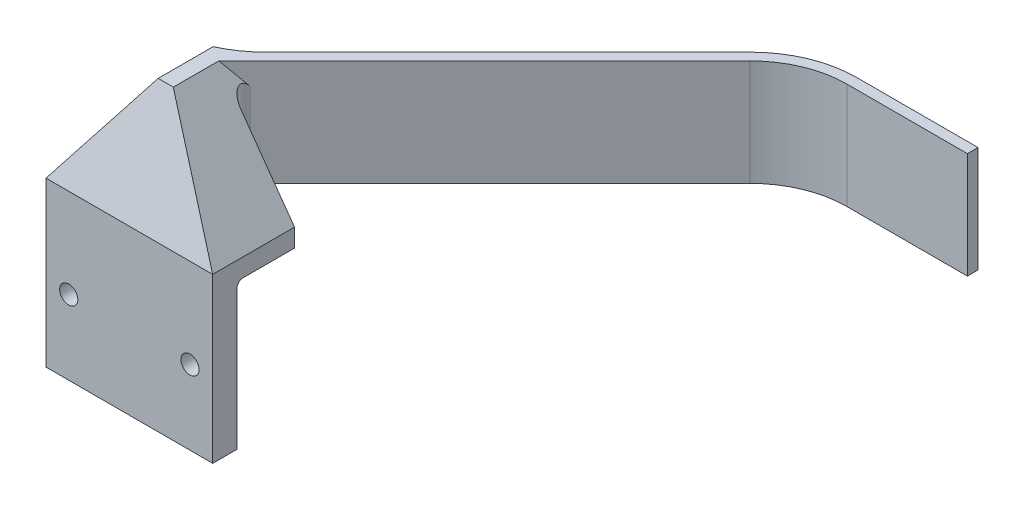
ISO-10303-21;
HEADER;
FILE_DESCRIPTION(('STEP AP214'),'2;1');
FILE_NAME('part.step','',(''),(''),'','','');
FILE_SCHEMA(('AUTOMOTIVE_DESIGN { 1 0 10303 214 1 1 1 1 }'));
ENDSEC;
DATA;
#1=APPLICATION_CONTEXT('core data for automotive mechanical design processes');
#2=APPLICATION_PROTOCOL_DEFINITION('international standard','automotive_design',2000,#1);
#3=PRODUCT_CONTEXT('',#1,'mechanical');
#4=PRODUCT('Part','Part','',(#3));
#5=PRODUCT_RELATED_PRODUCT_CATEGORY('part','',(#4));
#6=PRODUCT_DEFINITION_FORMATION('','',#4);
#7=PRODUCT_DEFINITION_CONTEXT('part definition',#1,'design');
#8=PRODUCT_DEFINITION('design','',#6,#7);
#9=PRODUCT_DEFINITION_SHAPE('','',#8);
#10=(LENGTH_UNIT() NAMED_UNIT(*) SI_UNIT(.MILLI.,.METRE.));
#11=(NAMED_UNIT(*) PLANE_ANGLE_UNIT() SI_UNIT($,.RADIAN.));
#12=(NAMED_UNIT(*) SI_UNIT($,.STERADIAN.) SOLID_ANGLE_UNIT());
#13=UNCERTAINTY_MEASURE_WITH_UNIT(LENGTH_MEASURE(1.E-05),#10,'distance_accuracy_value','');
#14=(GEOMETRIC_REPRESENTATION_CONTEXT(3) GLOBAL_UNCERTAINTY_ASSIGNED_CONTEXT((#13)) GLOBAL_UNIT_ASSIGNED_CONTEXT((#10,
#11,#12)) REPRESENTATION_CONTEXT('',''));
#15=CARTESIAN_POINT('',(0.,0.,0.));
#16=DIRECTION('',(0.,0.,1.));
#17=DIRECTION('',(1.,0.,0.));
#18=AXIS2_PLACEMENT_3D('',#15,#16,#17);
#19=CARTESIAN_POINT('',(-27.5,30.,-19.));
#20=DIRECTION('',(0.,0.,1.));
#21=DIRECTION('',(1.,0.,0.));
#22=AXIS2_PLACEMENT_3D('',#19,#20,#21);
#23=PLANE('',#22);
#24=DIRECTION('',(1.,0.,0.));
#25=VECTOR('',#24,1.);
#26=CARTESIAN_POINT('',(2.5,30.,-19.));
#27=LINE('',#26,#25);
#28=CARTESIAN_POINT('',(-16.9974746830584,30.,-19.));
#29=VERTEX_POINT('',#28);
#30=CARTESIAN_POINT('',(9.74264068711933,30.,-19.));
#31=VERTEX_POINT('',#30);
#32=EDGE_CURVE('E336',#29,#31,#27,.T.);
#33=ORIENTED_EDGE('',*,*,#32,.T.);
#34=DIRECTION('',(0.,1.,0.));
#35=VECTOR('',#34,1.);
#36=CARTESIAN_POINT('',(9.74264068711933,30.,-19.));
#37=LINE('',#36,#35);
#38=CARTESIAN_POINT('',(9.74264068711933,54.8603030380329,-19.));
#39=VERTEX_POINT('',#38);
#40=EDGE_CURVE('E323',#31,#39,#37,.T.);
#41=ORIENTED_EDGE('',*,*,#40,.T.);
#42=DIRECTION('',(0.581238193719096,-0.813733471206735,0.));
#43=VECTOR('',#42,1.);
#44=CARTESIAN_POINT('',(27.5,30.,-19.));
#45=LINE('',#44,#43);
#46=CARTESIAN_POINT('',(27.5,30.,-19.));
#47=VERTEX_POINT('',#46);
#48=EDGE_CURVE('E220',#39,#47,#45,.T.);
#49=ORIENTED_EDGE('',*,*,#48,.T.);
#50=DIRECTION('',(0.,-1.,0.));
#51=VECTOR('',#50,1.);
#52=CARTESIAN_POINT('',(27.5,30.,-19.));
#53=LINE('',#52,#51);
#54=CARTESIAN_POINT('',(27.5,24.,-19.));
#55=VERTEX_POINT('',#54);
#56=EDGE_CURVE('E250',#47,#55,#53,.T.);
#57=ORIENTED_EDGE('',*,*,#56,.T.);
#58=DIRECTION('',(-1.,0.,0.));
#59=VECTOR('',#58,1.);
#60=CARTESIAN_POINT('',(-27.5,24.,-19.));
#61=LINE('',#60,#59);
#62=CARTESIAN_POINT('',(-27.5,24.,-19.));
#63=VERTEX_POINT('',#62);
#64=EDGE_CURVE('E237',#55,#63,#61,.T.);
#65=ORIENTED_EDGE('',*,*,#64,.T.);
#66=DIRECTION('',(0.,-1.,0.));
#67=VECTOR('',#66,1.);
#68=CARTESIAN_POINT('',(-27.5,30.,-19.));
#69=LINE('',#68,#67);
#70=CARTESIAN_POINT('',(-27.5,30.,-19.));
#71=VERTEX_POINT('',#70);
#72=EDGE_CURVE('E242',#71,#63,#69,.T.);
#73=ORIENTED_EDGE('',*,*,#72,.F.);
#74=DIRECTION('',(-0.581238193719096,-0.813733471206735,0.));
#75=VECTOR('',#74,1.);
#76=CARTESIAN_POINT('',(-27.5,30.,-19.));
#77=LINE('',#76,#75);
#78=CARTESIAN_POINT('',(-16.9974746830584,44.7035354437182,-19.));
#79=VERTEX_POINT('',#78);
#80=EDGE_CURVE('E214',#79,#71,#77,.T.);
#81=ORIENTED_EDGE('',*,*,#80,.F.);
#82=DIRECTION('',(0.,1.,0.));
#83=VECTOR('',#82,1.);
#84=CARTESIAN_POINT('',(-16.9974746830584,30.,-19.));
#85=LINE('',#84,#83);
#86=EDGE_CURVE('E313',#79,#29,#85,.F.);
#87=ORIENTED_EDGE('',*,*,#86,.T.);
#88=EDGE_LOOP('',(#33,#41,#49,#57,#65,#73,#81,#87));
#89=FACE_BOUND('',#88,.T.);
#90=ADVANCED_FACE('F41',(#89),#23,.F.);
#91=CARTESIAN_POINT('',(0.,0.,8.));
#92=DIRECTION('',(0.,0.,-1.));
#93=DIRECTION('',(-1.,0.,0.));
#94=AXIS2_PLACEMENT_3D('',#91,#92,#93);
#95=PLANE('',#94);
#96=DIRECTION('',(0.,1.,0.));
#97=VECTOR('',#96,1.);
#98=CARTESIAN_POINT('',(27.5,-24.,8.));
#99=LINE('',#98,#97);
#100=CARTESIAN_POINT('',(27.5,-24.,8.));
#101=VERTEX_POINT('',#100);
#102=CARTESIAN_POINT('',(27.5,30.,8.));
#103=VERTEX_POINT('',#102);
#104=EDGE_CURVE('E266',#101,#103,#99,.T.);
#105=ORIENTED_EDGE('',*,*,#104,.T.);
#106=DIRECTION('',(1.,0.,0.));
#107=VECTOR('',#106,1.);
#108=CARTESIAN_POINT('',(-27.5,30.,8.));
#109=LINE('',#108,#107);
#110=CARTESIAN_POINT('',(-27.5,30.,8.));
#111=VERTEX_POINT('',#110);
#112=EDGE_CURVE('E236',#111,#103,#109,.T.);
#113=ORIENTED_EDGE('',*,*,#112,.F.);
#114=DIRECTION('',(0.,-1.,0.));
#115=VECTOR('',#114,1.);
#116=CARTESIAN_POINT('',(-27.5,-24.,8.));
#117=LINE('',#116,#115);
#118=CARTESIAN_POINT('',(-27.5,-24.,8.));
#119=VERTEX_POINT('',#118);
#120=EDGE_CURVE('E269',#111,#119,#117,.T.);
#121=ORIENTED_EDGE('',*,*,#120,.T.);
#122=DIRECTION('',(1.,0.,0.));
#123=VECTOR('',#122,1.);
#124=CARTESIAN_POINT('',(-27.5,-24.,8.));
#125=LINE('',#124,#123);
#126=EDGE_CURVE('E272',#119,#101,#125,.T.);
#127=ORIENTED_EDGE('',*,*,#126,.T.);
#128=EDGE_LOOP('',(#105,#113,#121,#127));
#129=FACE_BOUND('',#128,.T.);
#130=CARTESIAN_POINT('',(20.,0.5,8.));
#131=DIRECTION('',(0.,0.,1.));
#132=DIRECTION('',(1.,0.,0.));
#133=AXIS2_PLACEMENT_3D('',#130,#131,#132);
#134=CIRCLE('',#133,3.);
#135=CARTESIAN_POINT('',(23.,0.5,8.));
#136=VERTEX_POINT('',#135);
#137=EDGE_CURVE('E260',#136,#136,#134,.T.);
#138=ORIENTED_EDGE('',*,*,#137,.F.);
#139=EDGE_LOOP('',(#138));
#140=FACE_BOUND('',#139,.T.);
#141=CARTESIAN_POINT('',(-20.,0.5,8.));
#142=DIRECTION('',(0.,0.,1.));
#143=DIRECTION('',(1.,0.,0.));
#144=AXIS2_PLACEMENT_3D('',#141,#142,#143);
#145=CIRCLE('',#144,3.);
#146=CARTESIAN_POINT('',(-17.,0.5,8.));
#147=VERTEX_POINT('',#146);
#148=EDGE_CURVE('E254',#147,#147,#145,.T.);
#149=ORIENTED_EDGE('',*,*,#148,.F.);
#150=EDGE_LOOP('',(#149));
#151=FACE_BOUND('',#150,.T.);
#152=ADVANCED_FACE('F371',(#129,#140,#151),#95,.F.);
#153=CARTESIAN_POINT('',(0.,0.,0.));
#154=DIRECTION('',(0.,0.,-1.));
#155=DIRECTION('',(-1.,0.,0.));
#156=AXIS2_PLACEMENT_3D('',#153,#154,#155);
#157=PLANE('',#156);
#158=DIRECTION('',(0.,1.,0.));
#159=VECTOR('',#158,1.);
#160=CARTESIAN_POINT('',(27.5,-24.,0.));
#161=LINE('',#160,#159);
#162=CARTESIAN_POINT('',(27.5,-24.,0.));
#163=VERTEX_POINT('',#162);
#164=CARTESIAN_POINT('',(27.5,22.,0.));
#165=VERTEX_POINT('',#164);
#166=EDGE_CURVE('E263',#163,#165,#161,.T.);
#167=ORIENTED_EDGE('',*,*,#166,.F.);
#168=DIRECTION('',(1.,0.,0.));
#169=VECTOR('',#168,1.);
#170=CARTESIAN_POINT('',(-27.5,-24.,0.));
#171=LINE('',#170,#169);
#172=CARTESIAN_POINT('',(-27.5,-24.,0.));
#173=VERTEX_POINT('',#172);
#174=EDGE_CURVE('E270',#173,#163,#171,.T.);
#175=ORIENTED_EDGE('',*,*,#174,.F.);
#176=DIRECTION('',(0.,-1.,0.));
#177=VECTOR('',#176,1.);
#178=CARTESIAN_POINT('',(-27.5,-24.,0.));
#179=LINE('',#178,#177);
#180=CARTESIAN_POINT('',(-27.5,22.,0.));
#181=VERTEX_POINT('',#180);
#182=EDGE_CURVE('E277',#181,#173,#179,.T.);
#183=ORIENTED_EDGE('',*,*,#182,.F.);
#184=DIRECTION('',(-1.,0.,0.));
#185=VECTOR('',#184,1.);
#186=CARTESIAN_POINT('',(27.5,22.,0.));
#187=LINE('',#186,#185);
#188=EDGE_CURVE('E287',#181,#165,#187,.F.);
#189=ORIENTED_EDGE('',*,*,#188,.T.);
#190=EDGE_LOOP('',(#167,#175,#183,#189));
#191=FACE_BOUND('',#190,.T.);
#192=CARTESIAN_POINT('',(20.,0.5,0.));
#193=DIRECTION('',(0.,0.,1.));
#194=DIRECTION('',(1.,0.,0.));
#195=AXIS2_PLACEMENT_3D('',#192,#193,#194);
#196=CIRCLE('',#195,3.);
#197=CARTESIAN_POINT('',(23.,0.5,0.));
#198=VERTEX_POINT('',#197);
#199=EDGE_CURVE('E257',#198,#198,#196,.T.);
#200=ORIENTED_EDGE('',*,*,#199,.T.);
#201=EDGE_LOOP('',(#200));
#202=FACE_BOUND('',#201,.T.);
#203=CARTESIAN_POINT('',(-20.,0.5,0.));
#204=DIRECTION('',(0.,0.,1.));
#205=DIRECTION('',(1.,0.,0.));
#206=AXIS2_PLACEMENT_3D('',#203,#204,#205);
#207=CIRCLE('',#206,3.);
#208=CARTESIAN_POINT('',(-17.,0.5,0.));
#209=VERTEX_POINT('',#208);
#210=EDGE_CURVE('E253',#209,#209,#207,.T.);
#211=ORIENTED_EDGE('',*,*,#210,.T.);
#212=EDGE_LOOP('',(#211));
#213=FACE_BOUND('',#212,.T.);
#214=ADVANCED_FACE('F407',(#191,#202,#213),#157,.T.);
#215=CARTESIAN_POINT('',(27.5,-24.,8.));
#216=DIRECTION('',(-1.,0.,0.));
#217=DIRECTION('',(0.,0.,1.));
#218=AXIS2_PLACEMENT_3D('',#215,#216,#217);
#219=PLANE('',#218);
#220=ORIENTED_EDGE('',*,*,#166,.T.);
#221=CARTESIAN_POINT('',(27.5,22.,-2.));
#222=DIRECTION('',(-1.,0.,0.));
#223=DIRECTION('',(0.,0.,1.));
#224=AXIS2_PLACEMENT_3D('',#221,#222,#223);
#225=CIRCLE('',#224,2.);
#226=CARTESIAN_POINT('',(27.5,24.,-2.));
#227=VERTEX_POINT('',#226);
#228=EDGE_CURVE('E291',#165,#227,#225,.T.);
#229=ORIENTED_EDGE('',*,*,#228,.T.);
#230=DIRECTION('',(0.,0.,-1.));
#231=VECTOR('',#230,1.);
#232=CARTESIAN_POINT('',(27.5,24.,8.));
#233=LINE('',#232,#231);
#234=EDGE_CURVE('E245',#227,#55,#233,.T.);
#235=ORIENTED_EDGE('',*,*,#234,.T.);
#236=ORIENTED_EDGE('',*,*,#56,.F.);
#237=DIRECTION('',(0.,0.,-1.));
#238=VECTOR('',#237,1.);
#239=CARTESIAN_POINT('',(27.5,30.,8.));
#240=LINE('',#239,#238);
#241=EDGE_CURVE('E239',#103,#47,#240,.T.);
#242=ORIENTED_EDGE('',*,*,#241,.F.);
#243=ORIENTED_EDGE('',*,*,#104,.F.);
#244=DIRECTION('',(0.,0.,-1.));
#245=VECTOR('',#244,1.);
#246=CARTESIAN_POINT('',(27.5,-24.,8.));
#247=LINE('',#246,#245);
#248=EDGE_CURVE('E274',#101,#163,#247,.T.);
#249=ORIENTED_EDGE('',*,*,#248,.T.);
#250=EDGE_LOOP('',(#220,#229,#235,#236,#242,#243,#249));
#251=FACE_BOUND('',#250,.T.);
#252=ADVANCED_FACE('F377',(#251),#219,.F.);
#253=CARTESIAN_POINT('',(-27.5,-24.,8.));
#254=DIRECTION('',(1.,0.,0.));
#255=DIRECTION('',(0.,0.,-1.));
#256=AXIS2_PLACEMENT_3D('',#253,#254,#255);
#257=PLANE('',#256);
#258=DIRECTION('',(0.,0.,1.));
#259=VECTOR('',#258,1.);
#260=CARTESIAN_POINT('',(-27.5,24.,8.));
#261=LINE('',#260,#259);
#262=CARTESIAN_POINT('',(-27.5,24.,-2.));
#263=VERTEX_POINT('',#262);
#264=EDGE_CURVE('E233',#63,#263,#261,.T.);
#265=ORIENTED_EDGE('',*,*,#264,.T.);
#266=CARTESIAN_POINT('',(-27.5,22.,-2.));
#267=DIRECTION('',(1.,0.,0.));
#268=DIRECTION('',(0.,0.,-1.));
#269=AXIS2_PLACEMENT_3D('',#266,#267,#268);
#270=CIRCLE('',#269,2.);
#271=EDGE_CURVE('E289',#263,#181,#270,.T.);
#272=ORIENTED_EDGE('',*,*,#271,.T.);
#273=ORIENTED_EDGE('',*,*,#182,.T.);
#274=DIRECTION('',(0.,0.,-1.));
#275=VECTOR('',#274,1.);
#276=CARTESIAN_POINT('',(-27.5,-24.,8.));
#277=LINE('',#276,#275);
#278=EDGE_CURVE('E282',#119,#173,#277,.T.);
#279=ORIENTED_EDGE('',*,*,#278,.F.);
#280=ORIENTED_EDGE('',*,*,#120,.F.);
#281=DIRECTION('',(0.,0.,1.));
#282=VECTOR('',#281,1.);
#283=CARTESIAN_POINT('',(-27.5,30.,8.));
#284=LINE('',#283,#282);
#285=EDGE_CURVE('E234',#71,#111,#284,.T.);
#286=ORIENTED_EDGE('',*,*,#285,.F.);
#287=ORIENTED_EDGE('',*,*,#72,.T.);
#288=EDGE_LOOP('',(#265,#272,#273,#279,#280,#286,#287));
#289=FACE_BOUND('',#288,.T.);
#290=ADVANCED_FACE('F388',(#289),#257,.F.);
#291=CARTESIAN_POINT('',(-27.5,-24.,8.));
#292=DIRECTION('',(0.,1.,0.));
#293=DIRECTION('',(0.,0.,1.));
#294=AXIS2_PLACEMENT_3D('',#291,#292,#293);
#295=PLANE('',#294);
#296=ORIENTED_EDGE('',*,*,#248,.F.);
#297=ORIENTED_EDGE('',*,*,#126,.F.);
#298=ORIENTED_EDGE('',*,*,#278,.T.);
#299=ORIENTED_EDGE('',*,*,#174,.T.);
#300=EDGE_LOOP('',(#296,#297,#298,#299));
#301=FACE_BOUND('',#300,.T.);
#302=ADVANCED_FACE('F418',(#301),#295,.F.);
#303=CARTESIAN_POINT('',(20.,0.5,8.));
#304=DIRECTION('',(0.,0.,-1.));
#305=DIRECTION('',(-1.,0.,0.));
#306=AXIS2_PLACEMENT_3D('',#303,#304,#305);
#307=CYLINDRICAL_SURFACE('',#306,3.);
#308=ORIENTED_EDGE('',*,*,#137,.T.);
#309=EDGE_LOOP('',(#308));
#310=FACE_BOUND('',#309,.T.);
#311=ORIENTED_EDGE('',*,*,#199,.F.);
#312=EDGE_LOOP('',(#311));
#313=FACE_BOUND('',#312,.T.);
#314=ADVANCED_FACE('F415',(#310,#313),#307,.F.);
#315=CARTESIAN_POINT('',(-20.,0.5,8.));
#316=DIRECTION('',(0.,0.,-1.));
#317=DIRECTION('',(-1.,0.,0.));
#318=AXIS2_PLACEMENT_3D('',#315,#316,#317);
#319=CYLINDRICAL_SURFACE('',#318,3.);
#320=ORIENTED_EDGE('',*,*,#148,.T.);
#321=EDGE_LOOP('',(#320));
#322=FACE_BOUND('',#321,.T.);
#323=ORIENTED_EDGE('',*,*,#210,.F.);
#324=EDGE_LOOP('',(#323));
#325=FACE_BOUND('',#324,.T.);
#326=ADVANCED_FACE('F412',(#322,#325),#319,.F.);
#327=CARTESIAN_POINT('',(0.,24.,0.));
#328=DIRECTION('',(0.,-1.,0.));
#329=DIRECTION('',(0.,0.,-1.));
#330=AXIS2_PLACEMENT_3D('',#327,#328,#329);
#331=PLANE('',#330);
#332=DIRECTION('',(-1.,0.,0.));
#333=VECTOR('',#332,1.);
#334=CARTESIAN_POINT('',(-27.5,24.,-2.));
#335=LINE('',#334,#333);
#336=EDGE_CURVE('E285',#227,#263,#335,.T.);
#337=ORIENTED_EDGE('',*,*,#336,.T.);
#338=ORIENTED_EDGE('',*,*,#264,.F.);
#339=ORIENTED_EDGE('',*,*,#64,.F.);
#340=ORIENTED_EDGE('',*,*,#234,.F.);
#341=EDGE_LOOP('',(#337,#338,#339,#340));
#342=FACE_BOUND('',#341,.T.);
#343=ADVANCED_FACE('F384',(#342),#331,.T.);
#344=CARTESIAN_POINT('',(2.5,65.,-4.));
#345=DIRECTION('',(0.,-1.,0.));
#346=DIRECTION('',(0.,0.,-1.));
#347=AXIS2_PLACEMENT_3D('',#344,#345,#346);
#348=PLANE('',#347);
#349=DIRECTION('',(-1.,0.,0.));
#350=VECTOR('',#349,1.);
#351=CARTESIAN_POINT('',(97.9999999999993,65.,-119.5));
#352=LINE('',#351,#350);
#353=CARTESIAN_POINT('',(152.5,65.,-119.5));
#354=VERTEX_POINT('',#353);
#355=CARTESIAN_POINT('',(112.497474683058,65.,-119.5));
#356=VERTEX_POINT('',#355);
#357=EDGE_CURVE('E210',#354,#356,#352,.T.);
#358=ORIENTED_EDGE('',*,*,#357,.T.);
#359=CARTESIAN_POINT('',(112.497474683058,65.,-84.5));
#360=DIRECTION('',(0.,-1.,0.));
#361=DIRECTION('',(0.,0.,-1.));
#362=AXIS2_PLACEMENT_3D('',#359,#360,#361);
#363=CIRCLE('',#362,35.);
#364=CARTESIAN_POINT('',(87.7487373415285,65.,-109.248737341529));
#365=VERTEX_POINT('',#364);
#366=EDGE_CURVE('E296',#356,#365,#363,.F.);
#367=ORIENTED_EDGE('',*,*,#366,.T.);
#368=DIRECTION('',(-0.707106781186545,0.,0.70710678118655));
#369=VECTOR('',#368,1.);
#370=CARTESIAN_POINT('',(-2.5,65.,-19.));
#371=LINE('',#370,#369);
#372=CARTESIAN_POINT('',(7.75126265847086,65.,-29.2512626584709));
#373=VERTEX_POINT('',#372);
#374=EDGE_CURVE('E201',#365,#373,#371,.T.);
#375=ORIENTED_EDGE('',*,*,#374,.T.);
#376=CARTESIAN_POINT('',(-16.9974746830584,65.,-54.));
#377=DIRECTION('',(0.,-1.,0.));
#378=DIRECTION('',(0.,0.,-1.));
#379=AXIS2_PLACEMENT_3D('',#376,#377,#378);
#380=CIRCLE('',#379,35.);
#381=CARTESIAN_POINT('',(-2.5,65.,-22.1437097606441));
#382=VERTEX_POINT('',#381);
#383=EDGE_CURVE('E316',#373,#382,#380,.T.);
#384=ORIENTED_EDGE('',*,*,#383,.T.);
#385=DIRECTION('',(0.,0.,1.));
#386=VECTOR('',#385,1.);
#387=CARTESIAN_POINT('',(-2.5,65.,-4.));
#388=LINE('',#387,#386);
#389=CARTESIAN_POINT('',(-2.5,65.,-4.));
#390=VERTEX_POINT('',#389);
#391=EDGE_CURVE('E225',#382,#390,#388,.T.);
#392=ORIENTED_EDGE('',*,*,#391,.T.);
#393=DIRECTION('',(-1.,0.,0.));
#394=VECTOR('',#393,1.);
#395=CARTESIAN_POINT('',(2.5,65.,-4.));
#396=LINE('',#395,#394);
#397=CARTESIAN_POINT('',(2.5,65.,-4.));
#398=VERTEX_POINT('',#397);
#399=EDGE_CURVE('E228',#398,#390,#396,.T.);
#400=ORIENTED_EDGE('',*,*,#399,.F.);
#401=DIRECTION('',(0.,0.,1.));
#402=VECTOR('',#401,1.);
#403=CARTESIAN_POINT('',(2.5,65.,-4.));
#404=LINE('',#403,#402);
#405=CARTESIAN_POINT('',(2.5,65.,-19.));
#406=VERTEX_POINT('',#405);
#407=EDGE_CURVE('E226',#406,#398,#404,.T.);
#408=ORIENTED_EDGE('',*,*,#407,.F.);
#409=DIRECTION('',(0.707106781186551,0.,-0.707106781186544));
#410=VECTOR('',#409,1.);
#411=CARTESIAN_POINT('',(99.5000000000009,65.,-116.));
#412=LINE('',#411,#410);
#413=CARTESIAN_POINT('',(90.1274169979704,65.,-106.62741699797));
#414=VERTEX_POINT('',#413);
#415=EDGE_CURVE('E204',#406,#414,#412,.T.);
#416=ORIENTED_EDGE('',*,*,#415,.T.);
#417=CARTESIAN_POINT('',(112.75483399594,65.,-84.));
#418=DIRECTION('',(0.,-1.,0.));
#419=DIRECTION('',(0.,0.,-1.));
#420=AXIS2_PLACEMENT_3D('',#417,#418,#419);
#421=CIRCLE('',#420,32.);
#422=CARTESIAN_POINT('',(112.75483399594,65.,-116.));
#423=VERTEX_POINT('',#422);
#424=EDGE_CURVE('E306',#414,#423,#421,.T.);
#425=ORIENTED_EDGE('',*,*,#424,.T.);
#426=DIRECTION('',(1.,0.,0.));
#427=VECTOR('',#426,1.);
#428=CARTESIAN_POINT('',(152.5,65.,-116.));
#429=LINE('',#428,#427);
#430=CARTESIAN_POINT('',(152.5,65.,-116.));
#431=VERTEX_POINT('',#430);
#432=EDGE_CURVE('E207',#423,#431,#429,.T.);
#433=ORIENTED_EDGE('',*,*,#432,.T.);
#434=DIRECTION('',(0.,0.,-1.));
#435=VECTOR('',#434,1.);
#436=CARTESIAN_POINT('',(152.5,65.,-119.5));
#437=LINE('',#436,#435);
#438=EDGE_CURVE('E190',#431,#354,#437,.T.);
#439=ORIENTED_EDGE('',*,*,#438,.T.);
#440=EDGE_LOOP('',(#358,#367,#375,#384,#392,#400,#408,#416,#425,#433,#439));
#441=FACE_BOUND('',#440,.T.);
#442=ADVANCED_FACE('F353',(#441),#348,.F.);
#443=CARTESIAN_POINT('',(0.,22.,-2.));
#444=DIRECTION('',(1.,0.,0.));
#445=DIRECTION('',(0.,0.,-1.));
#446=AXIS2_PLACEMENT_3D('',#443,#444,#445);
#447=CYLINDRICAL_SURFACE('',#446,2.);
#448=ORIENTED_EDGE('',*,*,#228,.F.);
#449=ORIENTED_EDGE('',*,*,#188,.F.);
#450=ORIENTED_EDGE('',*,*,#271,.F.);
#451=ORIENTED_EDGE('',*,*,#336,.F.);
#452=EDGE_LOOP('',(#448,#449,#450,#451));
#453=FACE_BOUND('',#452,.T.);
#454=ADVANCED_FACE('F431',(#453),#447,.F.);
#455=CARTESIAN_POINT('',(0.,65.,-4.));
#456=DIRECTION('',(0.,0.324324324324324,0.945945945945946));
#457=DIRECTION('',(0.,-0.945945945945946,0.324324324324324));
#458=AXIS2_PLACEMENT_3D('',#455,#456,#457);
#459=PLANE('',#458);
#460=ORIENTED_EDGE('',*,*,#399,.T.);
#461=DIRECTION('',(-0.559857411277987,-0.783800375789181,0.268731557413434));
#462=VECTOR('',#461,1.);
#463=CARTESIAN_POINT('',(-33.2533395102493,21.9453246856509,10.7616029649197));
#464=LINE('',#463,#462);
#465=EDGE_CURVE('E217',#390,#111,#464,.T.);
#466=ORIENTED_EDGE('',*,*,#465,.T.);
#467=ORIENTED_EDGE('',*,*,#112,.T.);
#468=DIRECTION('',(0.559857411277987,-0.783800375789181,0.268731557413434));
#469=VECTOR('',#468,1.);
#470=CARTESIAN_POINT('',(33.2533395102493,21.9453246856509,10.7616029649197));
#471=LINE('',#470,#469);
#472=EDGE_CURVE('E222',#398,#103,#471,.T.);
#473=ORIENTED_EDGE('',*,*,#472,.F.);
#474=EDGE_LOOP('',(#460,#466,#467,#473));
#475=FACE_BOUND('',#474,.T.);
#476=ADVANCED_FACE('F366',(#475),#459,.T.);
#477=CARTESIAN_POINT('',(27.5,30.,46.2405299447906));
#478=DIRECTION('',(0.813733471206735,0.581238193719096,0.));
#479=DIRECTION('',(-0.581238193719096,0.813733471206735,0.));
#480=AXIS2_PLACEMENT_3D('',#477,#478,#479);
#481=PLANE('',#480);
#482=ORIENTED_EDGE('',*,*,#407,.T.);
#483=ORIENTED_EDGE('',*,*,#472,.T.);
#484=ORIENTED_EDGE('',*,*,#241,.T.);
#485=ORIENTED_EDGE('',*,*,#48,.F.);
#486=CARTESIAN_POINT('',(9.74264068711933,54.8603030380329,-22.));
#487=DIRECTION('',(0.813733471206735,0.581238193719096,0.));
#488=DIRECTION('',(-0.581238193719096,0.813733471206735,0.));
#489=AXIS2_PLACEMENT_3D('',#486,#487,#488);
#490=ELLIPSE('',#489,5.16139516022558,3.);
#491=CARTESIAN_POINT('',(7.62132034355972,57.8301515190164,-24.1213203435597));
#492=VERTEX_POINT('',#491);
#493=EDGE_CURVE('E49',#39,#492,#490,.F.);
#494=ORIENTED_EDGE('',*,*,#493,.T.);
#495=DIRECTION('',(0.502518907629607,-0.70352647068145,-0.502518907629603));
#496=VECTOR('',#495,1.);
#497=CARTESIAN_POINT('',(4.7119873876793,61.903217657249,-21.2119873876793));
#498=LINE('',#497,#496);
#499=EDGE_CURVE('E56',#406,#492,#498,.T.);
#500=ORIENTED_EDGE('',*,*,#499,.F.);
#501=EDGE_LOOP('',(#482,#483,#484,#485,#494,#500));
#502=FACE_BOUND('',#501,.T.);
#503=ADVANCED_FACE('F363',(#502),#481,.T.);
#504=CARTESIAN_POINT('',(-27.5,30.,46.2405299447906));
#505=DIRECTION('',(0.813733471206735,-0.581238193719096,0.));
#506=DIRECTION('',(0.581238193719096,0.813733471206735,0.));
#507=AXIS2_PLACEMENT_3D('',#504,#505,#506);
#508=PLANE('',#507);
#509=ORIENTED_EDGE('',*,*,#465,.F.);
#510=ORIENTED_EDGE('',*,*,#391,.F.);
#511=CARTESIAN_POINT('',(-16.9974746830584,44.7035354437182,-54.));
#512=DIRECTION('',(0.813733471206735,-0.581238193719096,0.));
#513=DIRECTION('',(0.581238193719096,0.813733471206735,0.));
#514=AXIS2_PLACEMENT_3D('',#511,#512,#513);
#515=ELLIPSE('',#514,60.2162768692984,35.);
#516=EDGE_CURVE('E319',#382,#79,#515,.T.);
#517=ORIENTED_EDGE('',*,*,#516,.T.);
#518=ORIENTED_EDGE('',*,*,#80,.T.);
#519=ORIENTED_EDGE('',*,*,#285,.T.);
#520=EDGE_LOOP('',(#509,#510,#517,#518,#519));
#521=FACE_BOUND('',#520,.T.);
#522=ADVANCED_FACE('F393',(#521),#508,.F.);
#523=CARTESIAN_POINT('',(-2.5,30.,-19.));
#524=DIRECTION('',(-0.70710678118655,0.,-0.707106781186545));
#525=DIRECTION('',(-0.707106781186545,0.,0.70710678118655));
#526=AXIS2_PLACEMENT_3D('',#523,#524,#525);
#527=PLANE('',#526);
#528=DIRECTION('',(-0.707106781186545,0.,0.70710678118655));
#529=VECTOR('',#528,1.);
#530=CARTESIAN_POINT('',(-2.5,30.,-19.));
#531=LINE('',#530,#529);
#532=CARTESIAN_POINT('',(87.7487373415285,30.,-109.248737341529));
#533=VERTEX_POINT('',#532);
#534=CARTESIAN_POINT('',(7.75126265847086,30.,-29.2512626584709));
#535=VERTEX_POINT('',#534);
#536=EDGE_CURVE('E213',#533,#535,#531,.T.);
#537=ORIENTED_EDGE('',*,*,#536,.T.);
#538=DIRECTION('',(0.,1.,0.));
#539=VECTOR('',#538,1.);
#540=CARTESIAN_POINT('',(7.75126265847086,30.,-29.2512626584709));
#541=LINE('',#540,#539);
#542=EDGE_CURVE('E310',#535,#373,#541,.T.);
#543=ORIENTED_EDGE('',*,*,#542,.T.);
#544=ORIENTED_EDGE('',*,*,#374,.F.);
#545=DIRECTION('',(0.,1.,0.));
#546=VECTOR('',#545,1.);
#547=CARTESIAN_POINT('',(87.7487373415284,30.,-109.248737341529));
#548=LINE('',#547,#546);
#549=EDGE_CURVE('E298',#365,#533,#548,.F.);
#550=ORIENTED_EDGE('',*,*,#549,.T.);
#551=EDGE_LOOP('',(#537,#543,#544,#550));
#552=FACE_BOUND('',#551,.T.);
#553=ADVANCED_FACE('F343',(#552),#527,.T.);
#554=CARTESIAN_POINT('',(97.9999999999993,30.,-119.5));
#555=DIRECTION('',(0.,0.,-1.));
#556=DIRECTION('',(-1.,0.,0.));
#557=AXIS2_PLACEMENT_3D('',#554,#555,#556);
#558=PLANE('',#557);
#559=DIRECTION('',(-1.,0.,0.));
#560=VECTOR('',#559,1.);
#561=CARTESIAN_POINT('',(97.9999999999993,30.,-119.5));
#562=LINE('',#561,#560);
#563=CARTESIAN_POINT('',(152.5,30.,-119.5));
#564=VERTEX_POINT('',#563);
#565=CARTESIAN_POINT('',(112.497474683058,30.,-119.5));
#566=VERTEX_POINT('',#565);
#567=EDGE_CURVE('E192',#564,#566,#562,.T.);
#568=ORIENTED_EDGE('',*,*,#567,.T.);
#569=DIRECTION('',(0.,1.,0.));
#570=VECTOR('',#569,1.);
#571=CARTESIAN_POINT('',(112.497474683058,30.,-119.5));
#572=LINE('',#571,#570);
#573=EDGE_CURVE('E293',#566,#356,#572,.T.);
#574=ORIENTED_EDGE('',*,*,#573,.T.);
#575=ORIENTED_EDGE('',*,*,#357,.F.);
#576=DIRECTION('',(0.,1.,0.));
#577=VECTOR('',#576,1.);
#578=CARTESIAN_POINT('',(152.5,30.,-119.5));
#579=LINE('',#578,#577);
#580=EDGE_CURVE('E191',#564,#354,#579,.T.);
#581=ORIENTED_EDGE('',*,*,#580,.F.);
#582=EDGE_LOOP('',(#568,#574,#575,#581));
#583=FACE_BOUND('',#582,.T.);
#584=ADVANCED_FACE('F358',(#583),#558,.T.);
#585=CARTESIAN_POINT('',(152.5,30.,-119.5));
#586=DIRECTION('',(1.,0.,0.));
#587=DIRECTION('',(0.,0.,-1.));
#588=AXIS2_PLACEMENT_3D('',#585,#586,#587);
#589=PLANE('',#588);
#590=ORIENTED_EDGE('',*,*,#438,.F.);
#591=DIRECTION('',(0.,1.,0.));
#592=VECTOR('',#591,1.);
#593=CARTESIAN_POINT('',(152.5,30.,-116.));
#594=LINE('',#593,#592);
#595=CARTESIAN_POINT('',(152.5,30.,-116.));
#596=VERTEX_POINT('',#595);
#597=EDGE_CURVE('E174',#596,#431,#594,.T.);
#598=ORIENTED_EDGE('',*,*,#597,.F.);
#599=DIRECTION('',(0.,0.,-1.));
#600=VECTOR('',#599,1.);
#601=CARTESIAN_POINT('',(152.5,30.,-119.5));
#602=LINE('',#601,#600);
#603=EDGE_CURVE('E182',#596,#564,#602,.T.);
#604=ORIENTED_EDGE('',*,*,#603,.T.);
#605=ORIENTED_EDGE('',*,*,#580,.T.);
#606=EDGE_LOOP('',(#590,#598,#604,#605));
#607=FACE_BOUND('',#606,.T.);
#608=ADVANCED_FACE('F187',(#607),#589,.T.);
#609=CARTESIAN_POINT('',(152.5,30.,-116.));
#610=DIRECTION('',(0.,0.,1.));
#611=DIRECTION('',(1.,0.,0.));
#612=AXIS2_PLACEMENT_3D('',#609,#610,#611);
#613=PLANE('',#612);
#614=ORIENTED_EDGE('',*,*,#432,.F.);
#615=DIRECTION('',(0.,1.,0.));
#616=VECTOR('',#615,1.);
#617=CARTESIAN_POINT('',(112.75483399594,30.,-116.));
#618=LINE('',#617,#616);
#619=CARTESIAN_POINT('',(112.75483399594,30.,-116.));
#620=VERTEX_POINT('',#619);
#621=EDGE_CURVE('E177',#423,#620,#618,.F.);
#622=ORIENTED_EDGE('',*,*,#621,.T.);
#623=DIRECTION('',(1.,0.,0.));
#624=VECTOR('',#623,1.);
#625=CARTESIAN_POINT('',(152.5,30.,-116.));
#626=LINE('',#625,#624);
#627=EDGE_CURVE('E170',#620,#596,#626,.T.);
#628=ORIENTED_EDGE('',*,*,#627,.T.);
#629=ORIENTED_EDGE('',*,*,#597,.T.);
#630=EDGE_LOOP('',(#614,#622,#628,#629));
#631=FACE_BOUND('',#630,.T.);
#632=ADVANCED_FACE('F173',(#631),#613,.T.);
#633=CARTESIAN_POINT('',(99.5000000000009,30.,-116.));
#634=DIRECTION('',(0.707106781186544,0.,0.707106781186551));
#635=DIRECTION('',(0.707106781186551,0.,-0.707106781186544));
#636=AXIS2_PLACEMENT_3D('',#633,#634,#635);
#637=PLANE('',#636);
#638=ORIENTED_EDGE('',*,*,#415,.F.);
#639=ORIENTED_EDGE('',*,*,#499,.T.);
#640=DIRECTION('',(0.,1.,0.));
#641=VECTOR('',#640,1.);
#642=CARTESIAN_POINT('',(7.62132034355972,30.,-24.1213203435597));
#643=LINE('',#642,#641);
#644=CARTESIAN_POINT('',(7.6213203435597,30.,-24.1213203435596));
#645=VERTEX_POINT('',#644);
#646=EDGE_CURVE('E326',#492,#645,#643,.F.);
#647=ORIENTED_EDGE('',*,*,#646,.T.);
#648=DIRECTION('',(0.707106781186551,0.,-0.707106781186544));
#649=VECTOR('',#648,1.);
#650=CARTESIAN_POINT('',(99.5000000000009,30.,-116.));
#651=LINE('',#650,#649);
#652=CARTESIAN_POINT('',(90.1274169979704,30.,-106.62741699797));
#653=VERTEX_POINT('',#652);
#654=EDGE_CURVE('E183',#645,#653,#651,.T.);
#655=ORIENTED_EDGE('',*,*,#654,.T.);
#656=DIRECTION('',(0.,1.,0.));
#657=VECTOR('',#656,1.);
#658=CARTESIAN_POINT('',(90.1274169979704,65.,-106.62741699797));
#659=LINE('',#658,#657);
#660=EDGE_CURVE('E302',#653,#414,#659,.T.);
#661=ORIENTED_EDGE('',*,*,#660,.T.);
#662=EDGE_LOOP('',(#638,#639,#647,#655,#661));
#663=FACE_BOUND('',#662,.T.);
#664=ADVANCED_FACE('F330',(#663),#637,.T.);
#665=CARTESIAN_POINT('',(0.,30.,0.));
#666=DIRECTION('',(0.,-1.,0.));
#667=DIRECTION('',(0.,0.,-1.));
#668=AXIS2_PLACEMENT_3D('',#665,#666,#667);
#669=PLANE('',#668);
#670=ORIENTED_EDGE('',*,*,#536,.F.);
#671=CARTESIAN_POINT('',(112.497474683058,30.,-84.5));
#672=DIRECTION('',(0.,-1.,0.));
#673=DIRECTION('',(0.,0.,-1.));
#674=AXIS2_PLACEMENT_3D('',#671,#672,#673);
#675=CIRCLE('',#674,35.);
#676=EDGE_CURVE('E300',#533,#566,#675,.T.);
#677=ORIENTED_EDGE('',*,*,#676,.T.);
#678=ORIENTED_EDGE('',*,*,#567,.F.);
#679=ORIENTED_EDGE('',*,*,#603,.F.);
#680=ORIENTED_EDGE('',*,*,#627,.F.);
#681=CARTESIAN_POINT('',(112.75483399594,30.,-84.));
#682=DIRECTION('',(0.,-1.,0.));
#683=DIRECTION('',(0.,0.,-1.));
#684=AXIS2_PLACEMENT_3D('',#681,#682,#683);
#685=CIRCLE('',#684,32.);
#686=EDGE_CURVE('E308',#620,#653,#685,.F.);
#687=ORIENTED_EDGE('',*,*,#686,.T.);
#688=ORIENTED_EDGE('',*,*,#654,.F.);
#689=CARTESIAN_POINT('',(9.74264068711933,30.,-22.));
#690=DIRECTION('',(0.,-1.,0.));
#691=DIRECTION('',(0.,0.,-1.));
#692=AXIS2_PLACEMENT_3D('',#689,#690,#691);
#693=CIRCLE('',#692,3.);
#694=EDGE_CURVE('E11',#645,#31,#693,.F.);
#695=ORIENTED_EDGE('',*,*,#694,.T.);
#696=ORIENTED_EDGE('',*,*,#32,.F.);
#697=CARTESIAN_POINT('',(-16.9974746830584,30.,-54.));
#698=DIRECTION('',(0.,-1.,0.));
#699=DIRECTION('',(0.,0.,-1.));
#700=AXIS2_PLACEMENT_3D('',#697,#698,#699);
#701=CIRCLE('',#700,35.);
#702=EDGE_CURVE('E321',#29,#535,#701,.F.);
#703=ORIENTED_EDGE('',*,*,#702,.T.);
#704=EDGE_LOOP('',(#670,#677,#678,#679,#680,#687,#688,#695,#696,#703));
#705=FACE_BOUND('',#704,.T.);
#706=ADVANCED_FACE('F195',(#705),#669,.T.);
#707=CARTESIAN_POINT('',(112.497474683058,30.,-84.5));
#708=DIRECTION('',(0.,1.,0.));
#709=DIRECTION('',(0.,0.,1.));
#710=AXIS2_PLACEMENT_3D('',#707,#708,#709);
#711=CYLINDRICAL_SURFACE('',#710,35.);
#712=ORIENTED_EDGE('',*,*,#676,.F.);
#713=ORIENTED_EDGE('',*,*,#549,.F.);
#714=ORIENTED_EDGE('',*,*,#366,.F.);
#715=ORIENTED_EDGE('',*,*,#573,.F.);
#716=EDGE_LOOP('',(#712,#713,#714,#715));
#717=FACE_BOUND('',#716,.T.);
#718=ADVANCED_FACE('F355',(#717),#711,.T.);
#719=CARTESIAN_POINT('',(112.75483399594,30.,-84.));
#720=DIRECTION('',(0.,-1.,0.));
#721=DIRECTION('',(0.,0.,-1.));
#722=AXIS2_PLACEMENT_3D('',#719,#720,#721);
#723=CYLINDRICAL_SURFACE('',#722,32.);
#724=ORIENTED_EDGE('',*,*,#686,.F.);
#725=ORIENTED_EDGE('',*,*,#621,.F.);
#726=ORIENTED_EDGE('',*,*,#424,.F.);
#727=ORIENTED_EDGE('',*,*,#660,.F.);
#728=EDGE_LOOP('',(#724,#725,#726,#727));
#729=FACE_BOUND('',#728,.T.);
#730=ADVANCED_FACE('F361',(#729),#723,.F.);
#731=CARTESIAN_POINT('',(-16.9974746830584,30.,-54.));
#732=DIRECTION('',(0.,1.,0.));
#733=DIRECTION('',(0.,0.,1.));
#734=AXIS2_PLACEMENT_3D('',#731,#732,#733);
#735=CYLINDRICAL_SURFACE('',#734,35.);
#736=ORIENTED_EDGE('',*,*,#702,.F.);
#737=ORIENTED_EDGE('',*,*,#86,.F.);
#738=ORIENTED_EDGE('',*,*,#516,.F.);
#739=ORIENTED_EDGE('',*,*,#383,.F.);
#740=ORIENTED_EDGE('',*,*,#542,.F.);
#741=EDGE_LOOP('',(#736,#737,#738,#739,#740));
#742=FACE_BOUND('',#741,.T.);
#743=ADVANCED_FACE('F349',(#742),#735,.F.);
#744=CARTESIAN_POINT('',(9.74264068711933,30.,-22.));
#745=DIRECTION('',(0.,1.,0.));
#746=DIRECTION('',(0.,0.,1.));
#747=AXIS2_PLACEMENT_3D('',#744,#745,#746);
#748=CYLINDRICAL_SURFACE('',#747,3.);
#749=ORIENTED_EDGE('',*,*,#694,.F.);
#750=ORIENTED_EDGE('',*,*,#646,.F.);
#751=ORIENTED_EDGE('',*,*,#493,.F.);
#752=ORIENTED_EDGE('',*,*,#40,.F.);
#753=EDGE_LOOP('',(#749,#750,#751,#752));
#754=FACE_BOUND('',#753,.T.);
#755=ADVANCED_FACE('F43',(#754),#748,.F.);
#756=CLOSED_SHELL('',(#90,#152,#214,#252,#290,#302,#314,#326,#343,#442,#454,#476,#503,#522,#553,
#584,#608,#632,#664,#706,#718,#730,#743,#755));
#757=MANIFOLD_SOLID_BREP('B2',#756);
#758=ADVANCED_BREP_SHAPE_REPRESENTATION('',(#18,#757),#14);
#759=SHAPE_DEFINITION_REPRESENTATION(#9,#758);
ENDSEC;
END-ISO-10303-21;
